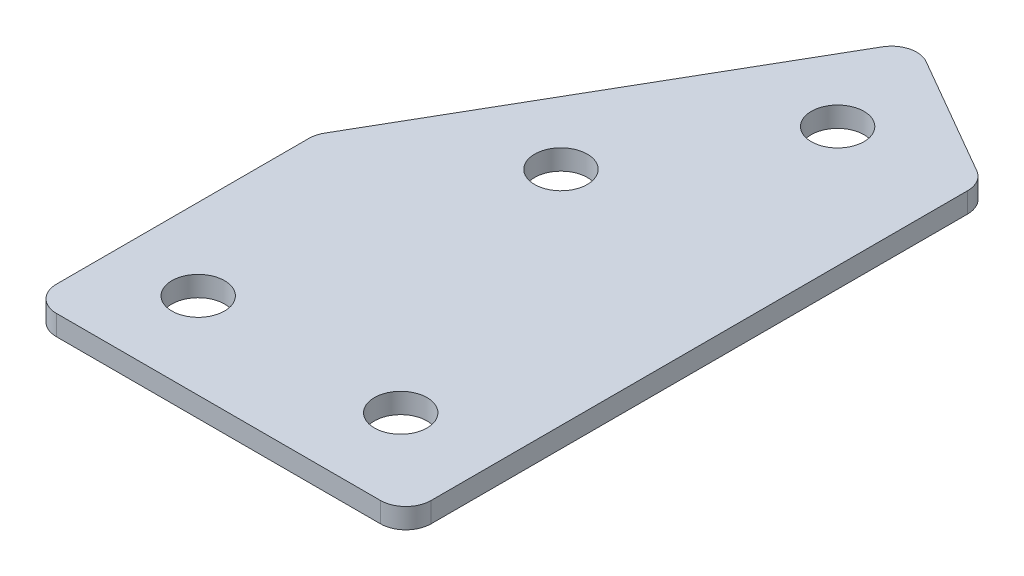
ISO-10303-21;
HEADER;
FILE_DESCRIPTION(('STEP AP214'),'2;1');
FILE_NAME('part.step','',(''),(''),'','','');
FILE_SCHEMA(('AUTOMOTIVE_DESIGN { 1 0 10303 214 1 1 1 1 }'));
ENDSEC;
DATA;
#1=APPLICATION_CONTEXT('core data for automotive mechanical design processes');
#2=APPLICATION_PROTOCOL_DEFINITION('international standard','automotive_design',2000,#1);
#3=PRODUCT_CONTEXT('',#1,'mechanical');
#4=PRODUCT('Part','Part','',(#3));
#5=PRODUCT_RELATED_PRODUCT_CATEGORY('part','',(#4));
#6=PRODUCT_DEFINITION_FORMATION('','',#4);
#7=PRODUCT_DEFINITION_CONTEXT('part definition',#1,'design');
#8=PRODUCT_DEFINITION('design','',#6,#7);
#9=PRODUCT_DEFINITION_SHAPE('','',#8);
#10=(LENGTH_UNIT() NAMED_UNIT(*) SI_UNIT(.MILLI.,.METRE.));
#11=(NAMED_UNIT(*) PLANE_ANGLE_UNIT() SI_UNIT($,.RADIAN.));
#12=(NAMED_UNIT(*) SI_UNIT($,.STERADIAN.) SOLID_ANGLE_UNIT());
#13=UNCERTAINTY_MEASURE_WITH_UNIT(LENGTH_MEASURE(1.E-05),#10,'distance_accuracy_value','');
#14=(GEOMETRIC_REPRESENTATION_CONTEXT(3) GLOBAL_UNCERTAINTY_ASSIGNED_CONTEXT((#13)) GLOBAL_UNIT_ASSIGNED_CONTEXT((#10,
#11,#12)) REPRESENTATION_CONTEXT('',''));
#15=CARTESIAN_POINT('',(0.,0.,0.));
#16=DIRECTION('',(0.,0.,1.));
#17=DIRECTION('',(1.,0.,0.));
#18=AXIS2_PLACEMENT_3D('',#15,#16,#17);
#19=CARTESIAN_POINT('',(-21.2659080191553,1.70798729371791,22.4673261572418));
#20=DIRECTION('',(0.,1.,0.));
#21=DIRECTION('',(0.,0.,1.));
#22=AXIS2_PLACEMENT_3D('',#19,#20,#21);
#23=PLANE('',#22);
#24=CARTESIAN_POINT('',(8.23409198085028,1.70798729371791,22.4673261572418));
#25=DIRECTION('',(0.,1.,0.));
#26=DIRECTION('',(0.,0.,1.));
#27=AXIS2_PLACEMENT_3D('',#24,#25,#26);
#28=CIRCLE('',#27,2.6);
#29=CARTESIAN_POINT('',(8.23409198085028,1.70798729371791,25.0673261572419));
#30=VERTEX_POINT('',#29);
#31=EDGE_CURVE('E201',#30,#30,#28,.T.);
#32=ORIENTED_EDGE('',*,*,#31,.T.);
#33=EDGE_LOOP('',(#32));
#34=FACE_BOUND('',#33,.T.);
#35=CARTESIAN_POINT('',(5.32383794300575,1.70798729371791,-23.5874648095606));
#36=DIRECTION('',(0.,1.,0.));
#37=DIRECTION('',(0.,0.,1.));
#38=AXIS2_PLACEMENT_3D('',#35,#36,#37);
#39=CIRCLE('',#38,2.6);
#40=CARTESIAN_POINT('',(5.32383794300575,1.70798729371791,-20.9874648095606));
#41=VERTEX_POINT('',#40);
#42=EDGE_CURVE('E195',#41,#41,#39,.T.);
#43=ORIENTED_EDGE('',*,*,#42,.T.);
#44=EDGE_LOOP('',(#43));
#45=FACE_BOUND('',#44,.T.);
#46=CARTESIAN_POINT('',(-4.67616205699425,1.70798729371791,-6.26695673387188));
#47=DIRECTION('',(0.,1.,0.));
#48=DIRECTION('',(0.,0.,1.));
#49=AXIS2_PLACEMENT_3D('',#46,#47,#48);
#50=CIRCLE('',#49,2.6);
#51=CARTESIAN_POINT('',(-4.67616205699425,1.70798729371791,-3.66695673387188));
#52=VERTEX_POINT('',#51);
#53=EDGE_CURVE('E189',#52,#52,#50,.T.);
#54=ORIENTED_EDGE('',*,*,#53,.T.);
#55=EDGE_LOOP('',(#54));
#56=FACE_BOUND('',#55,.T.);
#57=CARTESIAN_POINT('',(-11.7659080191497,1.70798729371791,22.4673261572418));
#58=DIRECTION('',(0.,1.,0.));
#59=DIRECTION('',(0.,0.,1.));
#60=AXIS2_PLACEMENT_3D('',#57,#58,#59);
#61=CIRCLE('',#60,2.6);
#62=CARTESIAN_POINT('',(-11.7659080191497,1.70798729371791,25.0673261572419));
#63=VERTEX_POINT('',#62);
#64=EDGE_CURVE('E115',#63,#63,#61,.T.);
#65=ORIENTED_EDGE('',*,*,#64,.T.);
#66=EDGE_LOOP('',(#65));
#67=FACE_BOUND('',#66,.T.);
#68=DIRECTION('',(0.,0.,1.));
#69=VECTOR('',#68,1.);
#70=CARTESIAN_POINT('',(-19.7659080191497,1.70798729371791,2.86924994588825));
#71=LINE('',#70,#69);
#72=CARTESIAN_POINT('',(-19.7659080191497,1.70798729371791,3.53912292696607));
#73=VERTEX_POINT('',#72);
#74=CARTESIAN_POINT('',(-19.7659080191497,1.70798729371791,28.467326157242));
#75=VERTEX_POINT('',#74);
#76=EDGE_CURVE('E182',#73,#75,#71,.T.);
#77=ORIENTED_EDGE('',*,*,#76,.F.);
#78=CARTESIAN_POINT('',(-17.2659080191497,1.70798729371791,3.53912292696607));
#79=DIRECTION('',(0.,1.,0.));
#80=DIRECTION('',(0.,0.,1.));
#81=AXIS2_PLACEMENT_3D('',#78,#79,#80);
#82=CIRCLE('',#81,2.5);
#83=CARTESIAN_POINT('',(-19.4309715286108,1.70798729371791,2.28912292696606));
#84=VERTEX_POINT('',#83);
#85=EDGE_CURVE('E146',#73,#84,#82,.F.);
#86=ORIENTED_EDGE('',*,*,#85,.T.);
#87=DIRECTION('',(-0.5,0.,0.866025403784439));
#88=VECTOR('',#87,1.);
#89=CARTESIAN_POINT('',(1.96262201083781,1.70798729371791,-34.7656680398362));
#90=LINE('',#89,#88);
#91=CARTESIAN_POINT('',(0.712622010837813,1.70798729371791,-32.6006045303752));
#92=VERTEX_POINT('',#91);
#93=EDGE_CURVE('E174',#92,#84,#90,.T.);
#94=ORIENTED_EDGE('',*,*,#93,.F.);
#95=CARTESIAN_POINT('',(2.87768552029891,1.70798729371791,-31.3506045303752));
#96=DIRECTION('',(0.,1.,0.));
#97=DIRECTION('',(0.,0.,1.));
#98=AXIS2_PLACEMENT_3D('',#95,#96,#97);
#99=CIRCLE('',#98,2.5);
#100=CARTESIAN_POINT('',(4.12768552029891,1.70798729371791,-33.5156680398363));
#101=VERTEX_POINT('',#100);
#102=EDGE_CURVE('E118',#92,#101,#99,.F.);
#103=ORIENTED_EDGE('',*,*,#102,.T.);
#104=DIRECTION('',(-0.866025403784439,0.,-0.499999999999999));
#105=VECTOR('',#104,1.);
#106=CARTESIAN_POINT('',(17.2340919808503,1.70798729371791,-25.9486807417283));
#107=LINE('',#106,#105);
#108=CARTESIAN_POINT('',(15.9840919808503,1.70798729371791,-26.6703685782153));
#109=VERTEX_POINT('',#108);
#110=EDGE_CURVE('E119',#109,#101,#107,.T.);
#111=ORIENTED_EDGE('',*,*,#110,.F.);
#112=CARTESIAN_POINT('',(14.7340919808503,1.70798729371791,-24.5053050687542));
#113=DIRECTION('',(0.,1.,0.));
#114=DIRECTION('',(0.,0.,1.));
#115=AXIS2_PLACEMENT_3D('',#112,#113,#114);
#116=CIRCLE('',#115,2.5);
#117=CARTESIAN_POINT('',(17.2340919808503,1.70798729371791,-24.5053050687542));
#118=VERTEX_POINT('',#117);
#119=EDGE_CURVE('E141',#109,#118,#116,.F.);
#120=ORIENTED_EDGE('',*,*,#119,.T.);
#121=DIRECTION('',(0.,0.,-1.));
#122=VECTOR('',#121,1.);
#123=CARTESIAN_POINT('',(17.2340919808503,1.70798729371791,30.967326157242));
#124=LINE('',#123,#122);
#125=CARTESIAN_POINT('',(17.2340919808503,1.70798729371791,28.467326157242));
#126=VERTEX_POINT('',#125);
#127=EDGE_CURVE('E123',#126,#118,#124,.T.);
#128=ORIENTED_EDGE('',*,*,#127,.F.);
#129=CARTESIAN_POINT('',(14.7340919808503,1.70798729371791,28.467326157242));
#130=DIRECTION('',(0.,1.,0.));
#131=DIRECTION('',(0.,0.,1.));
#132=AXIS2_PLACEMENT_3D('',#129,#130,#131);
#133=CIRCLE('',#132,2.5);
#134=CARTESIAN_POINT('',(14.7340919808503,1.70798729371791,30.967326157242));
#135=VERTEX_POINT('',#134);
#136=EDGE_CURVE('E31',#126,#135,#133,.F.);
#137=ORIENTED_EDGE('',*,*,#136,.T.);
#138=DIRECTION('',(1.,0.,0.));
#139=VECTOR('',#138,1.);
#140=CARTESIAN_POINT('',(-19.7659080191497,1.70798729371791,30.967326157242));
#141=LINE('',#140,#139);
#142=CARTESIAN_POINT('',(-17.2659080191497,1.70798729371791,30.967326157242));
#143=VERTEX_POINT('',#142);
#144=EDGE_CURVE('E180',#143,#135,#141,.T.);
#145=ORIENTED_EDGE('',*,*,#144,.F.);
#146=CARTESIAN_POINT('',(-17.2659080191497,1.70798729371791,28.467326157242));
#147=DIRECTION('',(0.,1.,0.));
#148=DIRECTION('',(0.,0.,1.));
#149=AXIS2_PLACEMENT_3D('',#146,#147,#148);
#150=CIRCLE('',#149,2.5);
#151=EDGE_CURVE('E144',#143,#75,#150,.F.);
#152=ORIENTED_EDGE('',*,*,#151,.T.);
#153=EDGE_LOOP('',(#77,#86,#94,#103,#111,#120,#128,#137,#145,#152));
#154=FACE_BOUND('',#153,.T.);
#155=ADVANCED_FACE('F16',(#34,#45,#56,#67,#154),#23,.F.);
#156=CARTESIAN_POINT('',(1.96262201083781,1.70798729371791,-34.7656680398362));
#157=DIRECTION('',(-0.866025403784439,0.,-0.5));
#158=DIRECTION('',(-0.5,0.,0.866025403784439));
#159=AXIS2_PLACEMENT_3D('',#156,#157,#158);
#160=PLANE('',#159);
#161=ORIENTED_EDGE('',*,*,#93,.T.);
#162=DIRECTION('',(0.,1.,0.));
#163=VECTOR('',#162,1.);
#164=CARTESIAN_POINT('',(-19.4309715286108,1.70798729371791,2.28912292696607));
#165=LINE('',#164,#163);
#166=CARTESIAN_POINT('',(-19.4309715286108,3.70798729371791,2.28912292696606));
#167=VERTEX_POINT('',#166);
#168=EDGE_CURVE('E105',#84,#167,#165,.T.);
#169=ORIENTED_EDGE('',*,*,#168,.T.);
#170=DIRECTION('',(-0.5,0.,0.866025403784439));
#171=VECTOR('',#170,1.);
#172=CARTESIAN_POINT('',(1.96262201083781,3.70798729371791,-34.7656680398362));
#173=LINE('',#172,#171);
#174=CARTESIAN_POINT('',(0.712622010837813,3.70798729371791,-32.6006045303752));
#175=VERTEX_POINT('',#174);
#176=EDGE_CURVE('E97',#175,#167,#173,.T.);
#177=ORIENTED_EDGE('',*,*,#176,.F.);
#178=DIRECTION('',(0.,1.,0.));
#179=VECTOR('',#178,1.);
#180=CARTESIAN_POINT('',(0.712622010837813,1.70798729371791,-32.6006045303752));
#181=LINE('',#180,#179);
#182=EDGE_CURVE('E111',#175,#92,#181,.F.);
#183=ORIENTED_EDGE('',*,*,#182,.T.);
#184=EDGE_LOOP('',(#161,#169,#177,#183));
#185=FACE_BOUND('',#184,.T.);
#186=ADVANCED_FACE('F110',(#185),#160,.T.);
#187=CARTESIAN_POINT('',(17.2340919808503,1.70798729371791,-25.9486807417283));
#188=DIRECTION('',(0.499999999999999,0.,-0.866025403784439));
#189=DIRECTION('',(-0.866025403784439,0.,-0.499999999999999));
#190=AXIS2_PLACEMENT_3D('',#187,#188,#189);
#191=PLANE('',#190);
#192=DIRECTION('',(-0.866025403784439,0.,-0.499999999999999));
#193=VECTOR('',#192,1.);
#194=CARTESIAN_POINT('',(17.2340919808503,3.70798729371791,-25.9486807417283));
#195=LINE('',#194,#193);
#196=CARTESIAN_POINT('',(15.9840919808503,3.70798729371791,-26.6703685782153));
#197=VERTEX_POINT('',#196);
#198=CARTESIAN_POINT('',(4.12768552029891,3.70798729371791,-33.5156680398363));
#199=VERTEX_POINT('',#198);
#200=EDGE_CURVE('E99',#197,#199,#195,.T.);
#201=ORIENTED_EDGE('',*,*,#200,.F.);
#202=DIRECTION('',(0.,1.,0.));
#203=VECTOR('',#202,1.);
#204=CARTESIAN_POINT('',(15.9840919808503,1.70798729371791,-26.6703685782153));
#205=LINE('',#204,#203);
#206=EDGE_CURVE('E10',#197,#109,#205,.F.);
#207=ORIENTED_EDGE('',*,*,#206,.T.);
#208=ORIENTED_EDGE('',*,*,#110,.T.);
#209=DIRECTION('',(0.,1.,0.));
#210=VECTOR('',#209,1.);
#211=CARTESIAN_POINT('',(4.12768552029891,1.70798729371791,-33.5156680398363));
#212=LINE('',#211,#210);
#213=EDGE_CURVE('E24',#101,#199,#212,.T.);
#214=ORIENTED_EDGE('',*,*,#213,.T.);
#215=EDGE_LOOP('',(#201,#207,#208,#214));
#216=FACE_BOUND('',#215,.T.);
#217=ADVANCED_FACE('F157',(#216),#191,.T.);
#218=CARTESIAN_POINT('',(17.2340919808503,1.70798729371791,30.967326157242));
#219=DIRECTION('',(1.,0.,0.));
#220=DIRECTION('',(0.,0.,-1.));
#221=AXIS2_PLACEMENT_3D('',#218,#219,#220);
#222=PLANE('',#221);
#223=DIRECTION('',(0.,0.,-1.));
#224=VECTOR('',#223,1.);
#225=CARTESIAN_POINT('',(17.2340919808503,3.70798729371791,30.967326157242));
#226=LINE('',#225,#224);
#227=CARTESIAN_POINT('',(17.2340919808503,3.70798729371791,28.467326157242));
#228=VERTEX_POINT('',#227);
#229=CARTESIAN_POINT('',(17.2340919808503,3.70798729371791,-24.5053050687542));
#230=VERTEX_POINT('',#229);
#231=EDGE_CURVE('E170',#228,#230,#226,.T.);
#232=ORIENTED_EDGE('',*,*,#231,.F.);
#233=DIRECTION('',(0.,1.,0.));
#234=VECTOR('',#233,1.);
#235=CARTESIAN_POINT('',(17.2340919808503,1.70798729371791,28.467326157242));
#236=LINE('',#235,#234);
#237=EDGE_CURVE('E155',#228,#126,#236,.F.);
#238=ORIENTED_EDGE('',*,*,#237,.T.);
#239=ORIENTED_EDGE('',*,*,#127,.T.);
#240=DIRECTION('',(0.,1.,0.));
#241=VECTOR('',#240,1.);
#242=CARTESIAN_POINT('',(17.2340919808503,1.70798729371791,-24.5053050687542));
#243=LINE('',#242,#241);
#244=EDGE_CURVE('E152',#118,#230,#243,.T.);
#245=ORIENTED_EDGE('',*,*,#244,.T.);
#246=EDGE_LOOP('',(#232,#238,#239,#245));
#247=FACE_BOUND('',#246,.T.);
#248=ADVANCED_FACE('F169',(#247),#222,.T.);
#249=CARTESIAN_POINT('',(-19.7659080191497,1.70798729371791,30.967326157242));
#250=DIRECTION('',(0.,0.,1.));
#251=DIRECTION('',(1.,0.,0.));
#252=AXIS2_PLACEMENT_3D('',#249,#250,#251);
#253=PLANE('',#252);
#254=DIRECTION('',(1.,0.,0.));
#255=VECTOR('',#254,1.);
#256=CARTESIAN_POINT('',(-19.7659080191497,3.70798729371791,30.967326157242));
#257=LINE('',#256,#255);
#258=CARTESIAN_POINT('',(-17.2659080191497,3.70798729371791,30.967326157242));
#259=VERTEX_POINT('',#258);
#260=CARTESIAN_POINT('',(14.7340919808503,3.70798729371791,30.967326157242));
#261=VERTEX_POINT('',#260);
#262=EDGE_CURVE('E173',#259,#261,#257,.T.);
#263=ORIENTED_EDGE('',*,*,#262,.F.);
#264=DIRECTION('',(0.,1.,0.));
#265=VECTOR('',#264,1.);
#266=CARTESIAN_POINT('',(-17.2659080191497,1.70798729371791,30.967326157242));
#267=LINE('',#266,#265);
#268=EDGE_CURVE('E38',#259,#143,#267,.F.);
#269=ORIENTED_EDGE('',*,*,#268,.T.);
#270=ORIENTED_EDGE('',*,*,#144,.T.);
#271=DIRECTION('',(0.,1.,0.));
#272=VECTOR('',#271,1.);
#273=CARTESIAN_POINT('',(14.7340919808503,1.70798729371791,30.967326157242));
#274=LINE('',#273,#272);
#275=EDGE_CURVE('E148',#135,#261,#274,.T.);
#276=ORIENTED_EDGE('',*,*,#275,.T.);
#277=EDGE_LOOP('',(#263,#269,#270,#276));
#278=FACE_BOUND('',#277,.T.);
#279=ADVANCED_FACE('F333',(#278),#253,.T.);
#280=CARTESIAN_POINT('',(-19.7659080191497,1.70798729371791,2.86924994588825));
#281=DIRECTION('',(-1.,0.,0.));
#282=DIRECTION('',(0.,0.,1.));
#283=AXIS2_PLACEMENT_3D('',#280,#281,#282);
#284=PLANE('',#283);
#285=DIRECTION('',(0.,0.,1.));
#286=VECTOR('',#285,1.);
#287=CARTESIAN_POINT('',(-19.7659080191497,3.70798729371791,2.86924994588825));
#288=LINE('',#287,#286);
#289=CARTESIAN_POINT('',(-19.7659080191497,3.70798729371791,3.53912292696607));
#290=VERTEX_POINT('',#289);
#291=CARTESIAN_POINT('',(-19.7659080191497,3.70798729371791,28.467326157242));
#292=VERTEX_POINT('',#291);
#293=EDGE_CURVE('E114',#290,#292,#288,.T.);
#294=ORIENTED_EDGE('',*,*,#293,.F.);
#295=DIRECTION('',(0.,1.,0.));
#296=VECTOR('',#295,1.);
#297=CARTESIAN_POINT('',(-19.7659080191497,1.70798729371791,3.53912292696607));
#298=LINE('',#297,#296);
#299=EDGE_CURVE('E138',#290,#73,#298,.F.);
#300=ORIENTED_EDGE('',*,*,#299,.T.);
#301=ORIENTED_EDGE('',*,*,#76,.T.);
#302=DIRECTION('',(0.,1.,0.));
#303=VECTOR('',#302,1.);
#304=CARTESIAN_POINT('',(-19.7659080191497,1.70798729371791,28.467326157242));
#305=LINE('',#304,#303);
#306=EDGE_CURVE('E135',#75,#292,#305,.T.);
#307=ORIENTED_EDGE('',*,*,#306,.T.);
#308=EDGE_LOOP('',(#294,#300,#301,#307));
#309=FACE_BOUND('',#308,.T.);
#310=ADVANCED_FACE('F223',(#309),#284,.T.);
#311=CARTESIAN_POINT('',(-21.2659080191553,3.70798729371791,22.4673261572418));
#312=DIRECTION('',(0.,1.,0.));
#313=DIRECTION('',(0.,0.,1.));
#314=AXIS2_PLACEMENT_3D('',#311,#312,#313);
#315=PLANE('',#314);
#316=CARTESIAN_POINT('',(8.23409198085028,3.70798729371791,22.4673261572418));
#317=DIRECTION('',(0.,1.,0.));
#318=DIRECTION('',(0.,0.,1.));
#319=AXIS2_PLACEMENT_3D('',#316,#317,#318);
#320=CIRCLE('',#319,2.6);
#321=CARTESIAN_POINT('',(8.23409198085028,3.70798729371791,25.0673261572419));
#322=VERTEX_POINT('',#321);
#323=EDGE_CURVE('E204',#322,#322,#320,.T.);
#324=ORIENTED_EDGE('',*,*,#323,.F.);
#325=EDGE_LOOP('',(#324));
#326=FACE_BOUND('',#325,.T.);
#327=CARTESIAN_POINT('',(5.32383794300575,3.70798729371791,-23.5874648095606));
#328=DIRECTION('',(0.,1.,0.));
#329=DIRECTION('',(0.,0.,1.));
#330=AXIS2_PLACEMENT_3D('',#327,#328,#329);
#331=CIRCLE('',#330,2.6);
#332=CARTESIAN_POINT('',(5.32383794300575,3.70798729371791,-20.9874648095606));
#333=VERTEX_POINT('',#332);
#334=EDGE_CURVE('E198',#333,#333,#331,.T.);
#335=ORIENTED_EDGE('',*,*,#334,.F.);
#336=EDGE_LOOP('',(#335));
#337=FACE_BOUND('',#336,.T.);
#338=CARTESIAN_POINT('',(-4.67616205699425,3.70798729371791,-6.26695673387188));
#339=DIRECTION('',(0.,1.,0.));
#340=DIRECTION('',(0.,0.,1.));
#341=AXIS2_PLACEMENT_3D('',#338,#339,#340);
#342=CIRCLE('',#341,2.6);
#343=CARTESIAN_POINT('',(-4.67616205699425,3.70798729371791,-3.66695673387188));
#344=VERTEX_POINT('',#343);
#345=EDGE_CURVE('E192',#344,#344,#342,.T.);
#346=ORIENTED_EDGE('',*,*,#345,.F.);
#347=EDGE_LOOP('',(#346));
#348=FACE_BOUND('',#347,.T.);
#349=CARTESIAN_POINT('',(-11.7659080191497,3.70798729371791,22.4673261572418));
#350=DIRECTION('',(0.,1.,0.));
#351=DIRECTION('',(0.,0.,1.));
#352=AXIS2_PLACEMENT_3D('',#349,#350,#351);
#353=CIRCLE('',#352,2.6);
#354=CARTESIAN_POINT('',(-11.7659080191497,3.70798729371791,25.0673261572419));
#355=VERTEX_POINT('',#354);
#356=EDGE_CURVE('E186',#355,#355,#353,.T.);
#357=ORIENTED_EDGE('',*,*,#356,.F.);
#358=EDGE_LOOP('',(#357));
#359=FACE_BOUND('',#358,.T.);
#360=ORIENTED_EDGE('',*,*,#176,.T.);
#361=CARTESIAN_POINT('',(-17.2659080191497,3.70798729371791,3.53912292696607));
#362=DIRECTION('',(0.,1.,0.));
#363=DIRECTION('',(0.,0.,1.));
#364=AXIS2_PLACEMENT_3D('',#361,#362,#363);
#365=CIRCLE('',#364,2.5);
#366=EDGE_CURVE('E133',#167,#290,#365,.T.);
#367=ORIENTED_EDGE('',*,*,#366,.T.);
#368=ORIENTED_EDGE('',*,*,#293,.T.);
#369=CARTESIAN_POINT('',(-17.2659080191497,3.70798729371791,28.467326157242));
#370=DIRECTION('',(0.,1.,0.));
#371=DIRECTION('',(0.,0.,1.));
#372=AXIS2_PLACEMENT_3D('',#369,#370,#371);
#373=CIRCLE('',#372,2.5);
#374=EDGE_CURVE('E131',#292,#259,#373,.T.);
#375=ORIENTED_EDGE('',*,*,#374,.T.);
#376=ORIENTED_EDGE('',*,*,#262,.T.);
#377=CARTESIAN_POINT('',(14.7340919808503,3.70798729371791,28.467326157242));
#378=DIRECTION('',(0.,1.,0.));
#379=DIRECTION('',(0.,0.,1.));
#380=AXIS2_PLACEMENT_3D('',#377,#378,#379);
#381=CIRCLE('',#380,2.5);
#382=EDGE_CURVE('E129',#261,#228,#381,.T.);
#383=ORIENTED_EDGE('',*,*,#382,.T.);
#384=ORIENTED_EDGE('',*,*,#231,.T.);
#385=CARTESIAN_POINT('',(14.7340919808503,3.70798729371791,-24.5053050687542));
#386=DIRECTION('',(0.,1.,0.));
#387=DIRECTION('',(0.,0.,1.));
#388=AXIS2_PLACEMENT_3D('',#385,#386,#387);
#389=CIRCLE('',#388,2.5);
#390=EDGE_CURVE('E104',#230,#197,#389,.T.);
#391=ORIENTED_EDGE('',*,*,#390,.T.);
#392=ORIENTED_EDGE('',*,*,#200,.T.);
#393=CARTESIAN_POINT('',(2.87768552029891,3.70798729371791,-31.3506045303752));
#394=DIRECTION('',(0.,1.,0.));
#395=DIRECTION('',(0.,0.,1.));
#396=AXIS2_PLACEMENT_3D('',#393,#394,#395);
#397=CIRCLE('',#396,2.5);
#398=EDGE_CURVE('E94',#199,#175,#397,.T.);
#399=ORIENTED_EDGE('',*,*,#398,.T.);
#400=EDGE_LOOP('',(#360,#367,#368,#375,#376,#383,#384,#391,#392,#399));
#401=FACE_BOUND('',#400,.T.);
#402=ADVANCED_FACE('F96',(#326,#337,#348,#359,#401),#315,.T.);
#403=CARTESIAN_POINT('',(-11.7659080191497,1.70798729371791,22.4673261572418));
#404=DIRECTION('',(0.,1.,0.));
#405=DIRECTION('',(0.,0.,1.));
#406=AXIS2_PLACEMENT_3D('',#403,#404,#405);
#407=CYLINDRICAL_SURFACE('',#406,2.6);
#408=ORIENTED_EDGE('',*,*,#64,.F.);
#409=EDGE_LOOP('',(#408));
#410=FACE_BOUND('',#409,.T.);
#411=ORIENTED_EDGE('',*,*,#356,.T.);
#412=EDGE_LOOP('',(#411));
#413=FACE_BOUND('',#412,.T.);
#414=ADVANCED_FACE('F222',(#410,#413),#407,.F.);
#415=CARTESIAN_POINT('',(-4.67616205699425,1.70798729371791,-6.26695673387188));
#416=DIRECTION('',(0.,1.,0.));
#417=DIRECTION('',(0.,0.,1.));
#418=AXIS2_PLACEMENT_3D('',#415,#416,#417);
#419=CYLINDRICAL_SURFACE('',#418,2.6);
#420=ORIENTED_EDGE('',*,*,#53,.F.);
#421=EDGE_LOOP('',(#420));
#422=FACE_BOUND('',#421,.T.);
#423=ORIENTED_EDGE('',*,*,#345,.T.);
#424=EDGE_LOOP('',(#423));
#425=FACE_BOUND('',#424,.T.);
#426=ADVANCED_FACE('F232',(#422,#425),#419,.F.);
#427=CARTESIAN_POINT('',(5.32383794300575,1.70798729371791,-23.5874648095606));
#428=DIRECTION('',(0.,1.,0.));
#429=DIRECTION('',(0.,0.,1.));
#430=AXIS2_PLACEMENT_3D('',#427,#428,#429);
#431=CYLINDRICAL_SURFACE('',#430,2.6);
#432=ORIENTED_EDGE('',*,*,#42,.F.);
#433=EDGE_LOOP('',(#432));
#434=FACE_BOUND('',#433,.T.);
#435=ORIENTED_EDGE('',*,*,#334,.T.);
#436=EDGE_LOOP('',(#435));
#437=FACE_BOUND('',#436,.T.);
#438=ADVANCED_FACE('F216',(#434,#437),#431,.F.);
#439=CARTESIAN_POINT('',(8.23409198085028,1.70798729371791,22.4673261572418));
#440=DIRECTION('',(0.,1.,0.));
#441=DIRECTION('',(0.,0.,1.));
#442=AXIS2_PLACEMENT_3D('',#439,#440,#441);
#443=CYLINDRICAL_SURFACE('',#442,2.6);
#444=ORIENTED_EDGE('',*,*,#31,.F.);
#445=EDGE_LOOP('',(#444));
#446=FACE_BOUND('',#445,.T.);
#447=ORIENTED_EDGE('',*,*,#323,.T.);
#448=EDGE_LOOP('',(#447));
#449=FACE_BOUND('',#448,.T.);
#450=ADVANCED_FACE('F212',(#446,#449),#443,.F.);
#451=CARTESIAN_POINT('',(-17.2659080191497,1.70798729371791,3.53912292696607));
#452=DIRECTION('',(0.,1.,0.));
#453=DIRECTION('',(0.,0.,1.));
#454=AXIS2_PLACEMENT_3D('',#451,#452,#453);
#455=CYLINDRICAL_SURFACE('',#454,2.5);
#456=ORIENTED_EDGE('',*,*,#85,.F.);
#457=ORIENTED_EDGE('',*,*,#299,.F.);
#458=ORIENTED_EDGE('',*,*,#366,.F.);
#459=ORIENTED_EDGE('',*,*,#168,.F.);
#460=EDGE_LOOP('',(#456,#457,#458,#459));
#461=FACE_BOUND('',#460,.T.);
#462=ADVANCED_FACE('F215',(#461),#455,.T.);
#463=CARTESIAN_POINT('',(-17.2659080191497,1.70798729371791,28.467326157242));
#464=DIRECTION('',(0.,1.,0.));
#465=DIRECTION('',(0.,0.,1.));
#466=AXIS2_PLACEMENT_3D('',#463,#464,#465);
#467=CYLINDRICAL_SURFACE('',#466,2.5);
#468=ORIENTED_EDGE('',*,*,#151,.F.);
#469=ORIENTED_EDGE('',*,*,#268,.F.);
#470=ORIENTED_EDGE('',*,*,#374,.F.);
#471=ORIENTED_EDGE('',*,*,#306,.F.);
#472=EDGE_LOOP('',(#468,#469,#470,#471));
#473=FACE_BOUND('',#472,.T.);
#474=ADVANCED_FACE('F252',(#473),#467,.T.);
#475=CARTESIAN_POINT('',(14.7340919808503,1.70798729371791,28.467326157242));
#476=DIRECTION('',(0.,1.,0.));
#477=DIRECTION('',(0.,0.,1.));
#478=AXIS2_PLACEMENT_3D('',#475,#476,#477);
#479=CYLINDRICAL_SURFACE('',#478,2.5);
#480=ORIENTED_EDGE('',*,*,#136,.F.);
#481=ORIENTED_EDGE('',*,*,#237,.F.);
#482=ORIENTED_EDGE('',*,*,#382,.F.);
#483=ORIENTED_EDGE('',*,*,#275,.F.);
#484=EDGE_LOOP('',(#480,#481,#482,#483));
#485=FACE_BOUND('',#484,.T.);
#486=ADVANCED_FACE('F256',(#485),#479,.T.);
#487=CARTESIAN_POINT('',(14.7340919808503,1.70798729371791,-24.5053050687542));
#488=DIRECTION('',(0.,1.,0.));
#489=DIRECTION('',(0.,0.,1.));
#490=AXIS2_PLACEMENT_3D('',#487,#488,#489);
#491=CYLINDRICAL_SURFACE('',#490,2.5);
#492=ORIENTED_EDGE('',*,*,#119,.F.);
#493=ORIENTED_EDGE('',*,*,#206,.F.);
#494=ORIENTED_EDGE('',*,*,#390,.F.);
#495=ORIENTED_EDGE('',*,*,#244,.F.);
#496=EDGE_LOOP('',(#492,#493,#494,#495));
#497=FACE_BOUND('',#496,.T.);
#498=ADVANCED_FACE('F165',(#497),#491,.T.);
#499=CARTESIAN_POINT('',(2.87768552029891,1.70798729371791,-31.3506045303752));
#500=DIRECTION('',(0.,1.,0.));
#501=DIRECTION('',(0.,0.,1.));
#502=AXIS2_PLACEMENT_3D('',#499,#500,#501);
#503=CYLINDRICAL_SURFACE('',#502,2.5);
#504=ORIENTED_EDGE('',*,*,#102,.F.);
#505=ORIENTED_EDGE('',*,*,#182,.F.);
#506=ORIENTED_EDGE('',*,*,#398,.F.);
#507=ORIENTED_EDGE('',*,*,#213,.F.);
#508=EDGE_LOOP('',(#504,#505,#506,#507));
#509=FACE_BOUND('',#508,.T.);
#510=ADVANCED_FACE('F18',(#509),#503,.T.);
#511=CLOSED_SHELL('',(#155,#186,#217,#248,#279,#310,#402,#414,#426,#438,#450,#462,#474,#486,
#498,#510));
#512=MANIFOLD_SOLID_BREP('B1',#511);
#513=ADVANCED_BREP_SHAPE_REPRESENTATION('',(#18,#512),#14);
#514=SHAPE_DEFINITION_REPRESENTATION(#9,#513);
ENDSEC;
END-ISO-10303-21;
